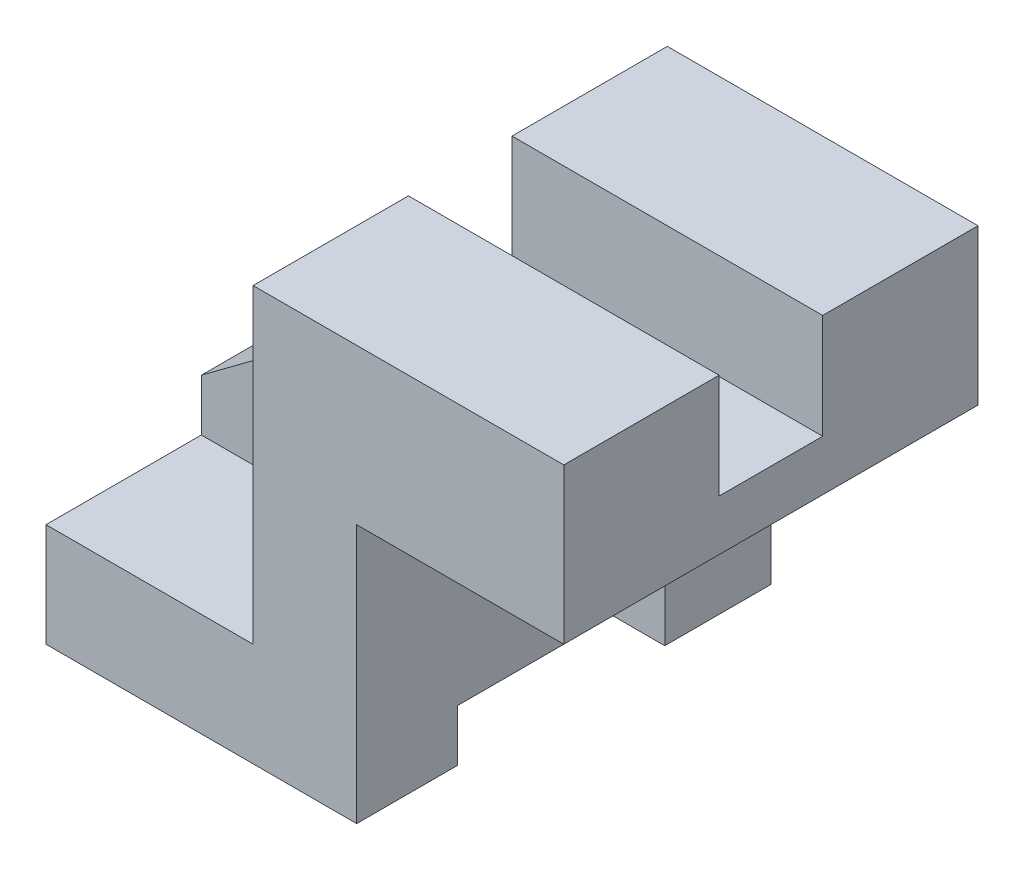
ISO-10303-21;
HEADER;
FILE_DESCRIPTION(('STEP AP214'),'2;1');
FILE_NAME('part.step','',(''),(''),'','','');
FILE_SCHEMA(('AUTOMOTIVE_DESIGN { 1 0 10303 214 1 1 1 1 }'));
ENDSEC;
DATA;
#1=APPLICATION_CONTEXT('core data for automotive mechanical design processes');
#2=APPLICATION_PROTOCOL_DEFINITION('international standard','automotive_design',2000,#1);
#3=PRODUCT_CONTEXT('',#1,'mechanical');
#4=PRODUCT('Part','Part','',(#3));
#5=PRODUCT_RELATED_PRODUCT_CATEGORY('part','',(#4));
#6=PRODUCT_DEFINITION_FORMATION('','',#4);
#7=PRODUCT_DEFINITION_CONTEXT('part definition',#1,'design');
#8=PRODUCT_DEFINITION('design','',#6,#7);
#9=PRODUCT_DEFINITION_SHAPE('','',#8);
#10=(LENGTH_UNIT() NAMED_UNIT(*) SI_UNIT(.MILLI.,.METRE.));
#11=(NAMED_UNIT(*) PLANE_ANGLE_UNIT() SI_UNIT($,.RADIAN.));
#12=(NAMED_UNIT(*) SI_UNIT($,.STERADIAN.) SOLID_ANGLE_UNIT());
#13=UNCERTAINTY_MEASURE_WITH_UNIT(LENGTH_MEASURE(1.E-05),#10,'distance_accuracy_value','');
#14=(GEOMETRIC_REPRESENTATION_CONTEXT(3) GLOBAL_UNCERTAINTY_ASSIGNED_CONTEXT((#13)) GLOBAL_UNIT_ASSIGNED_CONTEXT((#10,
#11,#12)) REPRESENTATION_CONTEXT('',''));
#15=CARTESIAN_POINT('',(0.,0.,0.));
#16=DIRECTION('',(0.,0.,1.));
#17=DIRECTION('',(1.,0.,0.));
#18=AXIS2_PLACEMENT_3D('',#15,#16,#17);
#19=CARTESIAN_POINT('',(0.,-48.7234042553192,40.));
#20=DIRECTION('',(0.,1.,0.));
#21=DIRECTION('',(0.,0.,1.));
#22=AXIS2_PLACEMENT_3D('',#19,#20,#21);
#23=PLANE('',#22);
#24=DIRECTION('',(0.,0.,-1.));
#25=VECTOR('',#24,1.);
#26=CARTESIAN_POINT('',(5.26825958416131,-48.7234042553192,40.));
#27=LINE('',#26,#25);
#28=CARTESIAN_POINT('',(5.26825958416131,-48.7234042553192,-19.5023751585269));
#29=VERTEX_POINT('',#28);
#30=CARTESIAN_POINT('',(5.26825958416131,-48.7234042553192,-40.));
#31=VERTEX_POINT('',#30);
#32=EDGE_CURVE('E192',#29,#31,#27,.T.);
#33=ORIENTED_EDGE('',*,*,#32,.F.);
#34=DIRECTION('',(-1.,0.,0.));
#35=VECTOR('',#34,1.);
#36=CARTESIAN_POINT('',(45.2692595841614,-48.7234042553191,-19.5023751585269));
#37=LINE('',#36,#35);
#38=CARTESIAN_POINT('',(-54.7317404158387,-48.7234042553192,-19.5023751585269));
#39=VERTEX_POINT('',#38);
#40=EDGE_CURVE('E177',#29,#39,#37,.T.);
#41=ORIENTED_EDGE('',*,*,#40,.T.);
#42=DIRECTION('',(0.,0.,-1.));
#43=VECTOR('',#42,1.);
#44=CARTESIAN_POINT('',(-54.7317404158387,-48.7234042553192,40.));
#45=LINE('',#44,#43);
#46=CARTESIAN_POINT('',(-54.7317404158387,-48.7234042553192,-40.));
#47=VERTEX_POINT('',#46);
#48=EDGE_CURVE('E207',#39,#47,#45,.T.);
#49=ORIENTED_EDGE('',*,*,#48,.T.);
#50=DIRECTION('',(1.,0.,0.));
#51=VECTOR('',#50,1.);
#52=CARTESIAN_POINT('',(0.,-48.7234042553192,-40.));
#53=LINE('',#52,#51);
#54=EDGE_CURVE('E198',#47,#31,#53,.T.);
#55=ORIENTED_EDGE('',*,*,#54,.T.);
#56=EDGE_LOOP('',(#33,#41,#49,#55));
#57=FACE_BOUND('',#56,.T.);
#58=ADVANCED_FACE('F45',(#57),#23,.F.);
#59=CARTESIAN_POINT('',(-14.7317404158387,0.,40.));
#60=DIRECTION('',(-1.,0.,0.));
#61=DIRECTION('',(0.,-1.,0.));
#62=AXIS2_PLACEMENT_3D('',#59,#60,#61);
#63=PLANE('',#62);
#64=DIRECTION('',(0.,-1.,0.));
#65=VECTOR('',#64,1.);
#66=CARTESIAN_POINT('',(-14.7317404158387,11.063829787234,-10.));
#67=LINE('',#66,#65);
#68=CARTESIAN_POINT('',(-14.7317404158387,31.2765957446809,-10.));
#69=VERTEX_POINT('',#68);
#70=CARTESIAN_POINT('',(-14.7317404158387,11.063829787234,-10.));
#71=VERTEX_POINT('',#70);
#72=EDGE_CURVE('E370',#69,#71,#67,.T.);
#73=ORIENTED_EDGE('',*,*,#72,.F.);
#74=DIRECTION('',(0.,0.,-1.));
#75=VECTOR('',#74,1.);
#76=CARTESIAN_POINT('',(-14.7317404158387,31.2765957446809,40.));
#77=LINE('',#76,#75);
#78=CARTESIAN_POINT('',(-14.7317404158387,31.2765957446809,-40.));
#79=VERTEX_POINT('',#78);
#80=EDGE_CURVE('E309',#69,#79,#77,.T.);
#81=ORIENTED_EDGE('',*,*,#80,.T.);
#82=DIRECTION('',(0.,1.,0.));
#83=VECTOR('',#82,1.);
#84=CARTESIAN_POINT('',(-14.7317404158387,0.,-40.));
#85=LINE('',#84,#83);
#86=CARTESIAN_POINT('',(-14.7317404158387,-28.7234042553192,-40.));
#87=VERTEX_POINT('',#86);
#88=EDGE_CURVE('E282',#87,#79,#85,.T.);
#89=ORIENTED_EDGE('',*,*,#88,.F.);
#90=DIRECTION('',(0.,0.,-1.));
#91=VECTOR('',#90,1.);
#92=CARTESIAN_POINT('',(-14.7317404158387,-28.7234042553192,-10.));
#93=LINE('',#92,#91);
#94=CARTESIAN_POINT('',(-14.7317404158387,-28.7234042553192,-10.));
#95=VERTEX_POINT('',#94);
#96=EDGE_CURVE('E252',#95,#87,#93,.T.);
#97=ORIENTED_EDGE('',*,*,#96,.F.);
#98=DIRECTION('',(0.,-1.,0.));
#99=VECTOR('',#98,1.);
#100=CARTESIAN_POINT('',(-14.7317404158387,11.063829787234,-10.));
#101=LINE('',#100,#99);
#102=EDGE_CURVE('E239',#71,#95,#101,.T.);
#103=ORIENTED_EDGE('',*,*,#102,.F.);
#104=EDGE_LOOP('',(#73,#81,#89,#97,#103));
#105=FACE_BOUND('',#104,.T.);
#106=ADVANCED_FACE('F367',(#105),#63,.T.);
#107=CARTESIAN_POINT('',(0.,31.2765957446809,40.));
#108=DIRECTION('',(0.,-1.,0.));
#109=DIRECTION('',(0.,0.,-1.));
#110=AXIS2_PLACEMENT_3D('',#107,#108,#109);
#111=PLANE('',#110);
#112=ORIENTED_EDGE('',*,*,#80,.F.);
#113=DIRECTION('',(-1.,0.,0.));
#114=VECTOR('',#113,1.);
#115=CARTESIAN_POINT('',(45.2692595841614,31.2765957446808,-10.));
#116=LINE('',#115,#114);
#117=CARTESIAN_POINT('',(45.2682595841613,31.2765957446808,-10.));
#118=VERTEX_POINT('',#117);
#119=EDGE_CURVE('E361',#118,#69,#116,.T.);
#120=ORIENTED_EDGE('',*,*,#119,.F.);
#121=DIRECTION('',(0.,0.,-1.));
#122=VECTOR('',#121,1.);
#123=CARTESIAN_POINT('',(45.2682595841613,31.2765957446809,40.));
#124=LINE('',#123,#122);
#125=CARTESIAN_POINT('',(45.2682595841613,31.2765957446809,-40.));
#126=VERTEX_POINT('',#125);
#127=EDGE_CURVE('E336',#118,#126,#124,.T.);
#128=ORIENTED_EDGE('',*,*,#127,.T.);
#129=DIRECTION('',(-1.,0.,0.));
#130=VECTOR('',#129,1.);
#131=CARTESIAN_POINT('',(0.,31.2765957446809,-40.));
#132=LINE('',#131,#130);
#133=EDGE_CURVE('E291',#126,#79,#132,.T.);
#134=ORIENTED_EDGE('',*,*,#133,.T.);
#135=EDGE_LOOP('',(#112,#120,#128,#134));
#136=FACE_BOUND('',#135,.T.);
#137=ADVANCED_FACE('F359',(#136),#111,.F.);
#138=DIRECTION('',(0.,1.,0.));
#139=VECTOR('',#138,1.);
#140=CARTESIAN_POINT('',(-14.7317404158387,11.063829787234,10.));
#141=LINE('',#140,#139);
#142=CARTESIAN_POINT('',(-14.7317404158387,11.063829787234,10.));
#143=VERTEX_POINT('',#142);
#144=CARTESIAN_POINT('',(-14.7317404158387,31.2765957446809,10.));
#145=VERTEX_POINT('',#144);
#146=EDGE_CURVE('E69',#143,#145,#141,.T.);
#147=ORIENTED_EDGE('',*,*,#146,.F.);
#148=DIRECTION('',(0.,1.,0.));
#149=VECTOR('',#148,1.);
#150=CARTESIAN_POINT('',(-14.7317404158387,11.063829787234,10.));
#151=LINE('',#150,#149);
#152=CARTESIAN_POINT('',(-14.7317404158387,-28.7234042553192,10.));
#153=VERTEX_POINT('',#152);
#154=EDGE_CURVE('E267',#153,#143,#151,.T.);
#155=ORIENTED_EDGE('',*,*,#154,.F.);
#156=DIRECTION('',(0.,0.,1.));
#157=VECTOR('',#156,1.);
#158=CARTESIAN_POINT('',(-14.7317404158387,-28.7234042553192,10.));
#159=LINE('',#158,#157);
#160=CARTESIAN_POINT('',(-14.7317404158387,-28.7234042553192,40.));
#161=VERTEX_POINT('',#160);
#162=EDGE_CURVE('E275',#153,#161,#159,.T.);
#163=ORIENTED_EDGE('',*,*,#162,.T.);
#164=DIRECTION('',(0.,1.,0.));
#165=VECTOR('',#164,1.);
#166=CARTESIAN_POINT('',(-14.7317404158387,0.,40.));
#167=LINE('',#166,#165);
#168=CARTESIAN_POINT('',(-14.7317404158387,31.2765957446809,40.));
#169=VERTEX_POINT('',#168);
#170=EDGE_CURVE('E286',#161,#169,#167,.T.);
#171=ORIENTED_EDGE('',*,*,#170,.T.);
#172=EDGE_CURVE('E332',#169,#145,#77,.T.);
#173=ORIENTED_EDGE('',*,*,#172,.T.);
#174=EDGE_LOOP('',(#147,#155,#163,#171,#173));
#175=FACE_BOUND('',#174,.T.);
#176=ADVANCED_FACE('F47',(#175),#63,.T.);
#177=CARTESIAN_POINT('',(-10.5551491000007,14.1740573628581,40.));
#178=DIRECTION('',(-0.597266145998167,0.802043110340396,0.));
#179=DIRECTION('',(-0.802043110340396,-0.597266145998167,0.));
#180=AXIS2_PLACEMENT_3D('',#177,#178,#179);
#181=PLANE('',#180);
#182=DIRECTION('',(0.802043110340396,0.597266145998167,0.));
#183=VECTOR('',#182,1.);
#184=CARTESIAN_POINT('',(-14.7317404158387,11.063829787234,-10.));
#185=LINE('',#184,#183);
#186=CARTESIAN_POINT('',(-54.7317404158387,-18.7234042553192,-10.));
#187=VERTEX_POINT('',#186);
#188=EDGE_CURVE('E234',#187,#71,#185,.T.);
#189=ORIENTED_EDGE('',*,*,#188,.F.);
#190=DIRECTION('',(0.,0.,-1.));
#191=VECTOR('',#190,1.);
#192=CARTESIAN_POINT('',(-54.7317404158387,-18.7234042553192,40.));
#193=LINE('',#192,#191);
#194=CARTESIAN_POINT('',(-54.7317404158387,-18.7234042553192,10.));
#195=VERTEX_POINT('',#194);
#196=EDGE_CURVE('E54',#195,#187,#193,.T.);
#197=ORIENTED_EDGE('',*,*,#196,.F.);
#198=DIRECTION('',(-0.802043110340396,-0.597266145998167,0.));
#199=VECTOR('',#198,1.);
#200=CARTESIAN_POINT('',(-54.7317404158387,-18.7234042553192,10.));
#201=LINE('',#200,#199);
#202=EDGE_CURVE('E232',#143,#195,#201,.T.);
#203=ORIENTED_EDGE('',*,*,#202,.F.);
#204=DIRECTION('',(0.,0.,-1.));
#205=VECTOR('',#204,1.);
#206=CARTESIAN_POINT('',(-14.7317404158387,11.063829787234,40.));
#207=LINE('',#206,#205);
#208=EDGE_CURVE('E11',#143,#71,#207,.T.);
#209=ORIENTED_EDGE('',*,*,#208,.T.);
#210=EDGE_LOOP('',(#189,#197,#203,#209));
#211=FACE_BOUND('',#210,.T.);
#212=ADVANCED_FACE('F231',(#211),#181,.T.);
#213=CARTESIAN_POINT('',(-54.7317404158387,0.,40.));
#214=DIRECTION('',(1.,0.,0.));
#215=DIRECTION('',(0.,1.,0.));
#216=AXIS2_PLACEMENT_3D('',#213,#214,#215);
#217=PLANE('',#216);
#218=ORIENTED_EDGE('',*,*,#48,.F.);
#219=DIRECTION('',(0.,-1.,0.));
#220=VECTOR('',#219,1.);
#221=CARTESIAN_POINT('',(-54.7317404158387,-48.7234042553192,-19.5023751585269));
#222=LINE('',#221,#220);
#223=CARTESIAN_POINT('',(-54.7317404158387,-38.7234042553192,-19.5023751585269));
#224=VERTEX_POINT('',#223);
#225=EDGE_CURVE('E182',#224,#39,#222,.T.);
#226=ORIENTED_EDGE('',*,*,#225,.F.);
#227=DIRECTION('',(0.,0.,-1.));
#228=VECTOR('',#227,1.);
#229=CARTESIAN_POINT('',(-54.7317404158387,-38.7234042553192,-19.5023751585269));
#230=LINE('',#229,#228);
#231=CARTESIAN_POINT('',(-54.7317404158387,-38.7234042553192,20.4976248414731));
#232=VERTEX_POINT('',#231);
#233=EDGE_CURVE('E188',#232,#224,#230,.T.);
#234=ORIENTED_EDGE('',*,*,#233,.F.);
#235=DIRECTION('',(0.,1.,0.));
#236=VECTOR('',#235,1.);
#237=CARTESIAN_POINT('',(-54.7317404158387,-48.7234042553192,20.4976248414731));
#238=LINE('',#237,#236);
#239=CARTESIAN_POINT('',(-54.7317404158387,-48.7234042553192,20.4976248414731));
#240=VERTEX_POINT('',#239);
#241=EDGE_CURVE('E412',#240,#232,#238,.T.);
#242=ORIENTED_EDGE('',*,*,#241,.F.);
#243=CARTESIAN_POINT('',(-54.7317404158387,-48.7234042553192,40.));
#244=VERTEX_POINT('',#243);
#245=EDGE_CURVE('E213',#244,#240,#45,.T.);
#246=ORIENTED_EDGE('',*,*,#245,.F.);
#247=DIRECTION('',(0.,-1.,0.));
#248=VECTOR('',#247,1.);
#249=CARTESIAN_POINT('',(-54.7317404158387,0.,40.));
#250=LINE('',#249,#248);
#251=CARTESIAN_POINT('',(-54.7317404158387,-28.7234042553192,40.));
#252=VERTEX_POINT('',#251);
#253=EDGE_CURVE('E290',#252,#244,#250,.T.);
#254=ORIENTED_EDGE('',*,*,#253,.F.);
#255=DIRECTION('',(0.,0.,1.));
#256=VECTOR('',#255,1.);
#257=CARTESIAN_POINT('',(-54.7317404158387,-28.7234042553192,10.));
#258=LINE('',#257,#256);
#259=CARTESIAN_POINT('',(-54.7317404158387,-28.7234042553192,10.));
#260=VERTEX_POINT('',#259);
#261=EDGE_CURVE('E279',#260,#252,#258,.T.);
#262=ORIENTED_EDGE('',*,*,#261,.F.);
#263=DIRECTION('',(0.,-1.,0.));
#264=VECTOR('',#263,1.);
#265=CARTESIAN_POINT('',(-54.7317404158387,-18.7234042553192,10.));
#266=LINE('',#265,#264);
#267=EDGE_CURVE('E227',#195,#260,#266,.T.);
#268=ORIENTED_EDGE('',*,*,#267,.F.);
#269=ORIENTED_EDGE('',*,*,#196,.T.);
#270=DIRECTION('',(0.,1.,0.));
#271=VECTOR('',#270,1.);
#272=CARTESIAN_POINT('',(-54.7317404158387,-18.7234042553192,-10.));
#273=LINE('',#272,#271);
#274=CARTESIAN_POINT('',(-54.7317404158387,-28.7234042553192,-10.));
#275=VERTEX_POINT('',#274);
#276=EDGE_CURVE('E224',#275,#187,#273,.T.);
#277=ORIENTED_EDGE('',*,*,#276,.F.);
#278=DIRECTION('',(0.,0.,-1.));
#279=VECTOR('',#278,1.);
#280=CARTESIAN_POINT('',(-54.7317404158387,-28.7234042553192,-10.));
#281=LINE('',#280,#279);
#282=CARTESIAN_POINT('',(-54.7317404158387,-28.7234042553192,-40.));
#283=VERTEX_POINT('',#282);
#284=EDGE_CURVE('E256',#275,#283,#281,.T.);
#285=ORIENTED_EDGE('',*,*,#284,.T.);
#286=DIRECTION('',(0.,-1.,0.));
#287=VECTOR('',#286,1.);
#288=CARTESIAN_POINT('',(-54.7317404158387,0.,-40.));
#289=LINE('',#288,#287);
#290=EDGE_CURVE('E313',#283,#47,#289,.T.);
#291=ORIENTED_EDGE('',*,*,#290,.T.);
#292=EDGE_LOOP('',(#218,#226,#234,#242,#246,#254,#262,#268,#269,#277,#285,#291));
#293=FACE_BOUND('',#292,.T.);
#294=ADVANCED_FACE('F222',(#293),#217,.F.);
#295=ORIENTED_EDGE('',*,*,#245,.T.);
#296=DIRECTION('',(-1.,0.,0.));
#297=VECTOR('',#296,1.);
#298=CARTESIAN_POINT('',(45.2692595841614,-48.7234042553191,20.4976248414731));
#299=LINE('',#298,#297);
#300=CARTESIAN_POINT('',(5.26825958416131,-48.7234042553191,20.4976248414731));
#301=VERTEX_POINT('',#300);
#302=EDGE_CURVE('E187',#301,#240,#299,.T.);
#303=ORIENTED_EDGE('',*,*,#302,.F.);
#304=CARTESIAN_POINT('',(5.26825958416131,-48.7234042553192,40.));
#305=VERTEX_POINT('',#304);
#306=EDGE_CURVE('E201',#305,#301,#27,.T.);
#307=ORIENTED_EDGE('',*,*,#306,.F.);
#308=DIRECTION('',(1.,0.,0.));
#309=VECTOR('',#308,1.);
#310=CARTESIAN_POINT('',(0.,-48.7234042553192,40.));
#311=LINE('',#310,#309);
#312=EDGE_CURVE('E294',#244,#305,#311,.T.);
#313=ORIENTED_EDGE('',*,*,#312,.F.);
#314=EDGE_LOOP('',(#295,#303,#307,#313));
#315=FACE_BOUND('',#314,.T.);
#316=ADVANCED_FACE('F428',(#315),#23,.F.);
#317=CARTESIAN_POINT('',(5.26825958416131,0.,40.));
#318=DIRECTION('',(-1.,0.,0.));
#319=DIRECTION('',(0.,0.,1.));
#320=AXIS2_PLACEMENT_3D('',#317,#318,#319);
#321=PLANE('',#320);
#322=DIRECTION('',(0.,0.,1.));
#323=VECTOR('',#322,1.);
#324=CARTESIAN_POINT('',(5.26825958416131,-38.7234042553191,-19.5023751585269));
#325=LINE('',#324,#323);
#326=CARTESIAN_POINT('',(5.26825958416131,-38.7234042553191,-19.5023751585269));
#327=VERTEX_POINT('',#326);
#328=CARTESIAN_POINT('',(5.26825958416131,-38.7234042553191,20.4976248414731));
#329=VERTEX_POINT('',#328);
#330=EDGE_CURVE('E61',#327,#329,#325,.T.);
#331=ORIENTED_EDGE('',*,*,#330,.F.);
#332=DIRECTION('',(0.,1.,0.));
#333=VECTOR('',#332,1.);
#334=CARTESIAN_POINT('',(5.26825958416131,-48.7234042553191,-19.5023751585269));
#335=LINE('',#334,#333);
#336=EDGE_CURVE('E180',#29,#327,#335,.T.);
#337=ORIENTED_EDGE('',*,*,#336,.F.);
#338=ORIENTED_EDGE('',*,*,#32,.T.);
#339=DIRECTION('',(0.,1.,0.));
#340=VECTOR('',#339,1.);
#341=CARTESIAN_POINT('',(5.26825958416131,0.,-40.));
#342=LINE('',#341,#340);
#343=CARTESIAN_POINT('',(5.26825958416131,1.27659574468085,-40.));
#344=VERTEX_POINT('',#343);
#345=EDGE_CURVE('E319',#31,#344,#342,.T.);
#346=ORIENTED_EDGE('',*,*,#345,.T.);
#347=DIRECTION('',(0.,0.,-1.));
#348=VECTOR('',#347,1.);
#349=CARTESIAN_POINT('',(5.26825958416131,1.27659574468085,40.));
#350=LINE('',#349,#348);
#351=CARTESIAN_POINT('',(5.26825958416131,1.27659574468085,40.));
#352=VERTEX_POINT('',#351);
#353=EDGE_CURVE('E202',#352,#344,#350,.T.);
#354=ORIENTED_EDGE('',*,*,#353,.F.);
#355=DIRECTION('',(0.,1.,0.));
#356=VECTOR('',#355,1.);
#357=CARTESIAN_POINT('',(5.26825958416131,0.,40.));
#358=LINE('',#357,#356);
#359=EDGE_CURVE('E297',#305,#352,#358,.T.);
#360=ORIENTED_EDGE('',*,*,#359,.F.);
#361=ORIENTED_EDGE('',*,*,#306,.T.);
#362=DIRECTION('',(0.,-1.,0.));
#363=VECTOR('',#362,1.);
#364=CARTESIAN_POINT('',(5.26825958416131,-48.7234042553191,20.4976248414731));
#365=LINE('',#364,#363);
#366=EDGE_CURVE('E420',#329,#301,#365,.T.);
#367=ORIENTED_EDGE('',*,*,#366,.F.);
#368=EDGE_LOOP('',(#331,#337,#338,#346,#354,#360,#361,#367));
#369=FACE_BOUND('',#368,.T.);
#370=ADVANCED_FACE('F191',(#369),#321,.F.);
#371=CARTESIAN_POINT('',(0.,1.27659574468085,40.));
#372=DIRECTION('',(0.,1.,0.));
#373=DIRECTION('',(0.,0.,1.));
#374=AXIS2_PLACEMENT_3D('',#371,#372,#373);
#375=PLANE('',#374);
#376=DIRECTION('',(1.,0.,0.));
#377=VECTOR('',#376,1.);
#378=CARTESIAN_POINT('',(0.,1.27659574468085,-40.));
#379=LINE('',#378,#377);
#380=CARTESIAN_POINT('',(45.2682595841613,1.27659574468085,-40.));
#381=VERTEX_POINT('',#380);
#382=EDGE_CURVE('E322',#344,#381,#379,.T.);
#383=ORIENTED_EDGE('',*,*,#382,.T.);
#384=DIRECTION('',(0.,0.,-1.));
#385=VECTOR('',#384,1.);
#386=CARTESIAN_POINT('',(45.2682595841613,1.27659574468085,40.));
#387=LINE('',#386,#385);
#388=CARTESIAN_POINT('',(45.2682595841613,1.27659574468085,40.));
#389=VERTEX_POINT('',#388);
#390=EDGE_CURVE('E209',#389,#381,#387,.T.);
#391=ORIENTED_EDGE('',*,*,#390,.F.);
#392=DIRECTION('',(1.,0.,0.));
#393=VECTOR('',#392,1.);
#394=CARTESIAN_POINT('',(0.,1.27659574468085,40.));
#395=LINE('',#394,#393);
#396=EDGE_CURVE('E300',#352,#389,#395,.T.);
#397=ORIENTED_EDGE('',*,*,#396,.F.);
#398=ORIENTED_EDGE('',*,*,#353,.T.);
#399=EDGE_LOOP('',(#383,#391,#397,#398));
#400=FACE_BOUND('',#399,.T.);
#401=ADVANCED_FACE('F459',(#400),#375,.F.);
#402=CARTESIAN_POINT('',(45.2682595841613,0.,40.));
#403=DIRECTION('',(-1.,0.,0.));
#404=DIRECTION('',(0.,-1.,0.));
#405=AXIS2_PLACEMENT_3D('',#402,#403,#404);
#406=PLANE('',#405);
#407=ORIENTED_EDGE('',*,*,#127,.F.);
#408=DIRECTION('',(0.,1.,0.));
#409=VECTOR('',#408,1.);
#410=CARTESIAN_POINT('',(45.2682595841613,11.063829787234,-10.));
#411=LINE('',#410,#409);
#412=CARTESIAN_POINT('',(45.2682595841613,11.063829787234,-10.));
#413=VERTEX_POINT('',#412);
#414=EDGE_CURVE('E379',#413,#118,#411,.T.);
#415=ORIENTED_EDGE('',*,*,#414,.F.);
#416=DIRECTION('',(0.,0.,-1.));
#417=VECTOR('',#416,1.);
#418=CARTESIAN_POINT('',(45.2682595841613,11.063829787234,-10.));
#419=LINE('',#418,#417);
#420=CARTESIAN_POINT('',(45.2682595841613,11.063829787234,10.));
#421=VERTEX_POINT('',#420);
#422=EDGE_CURVE('E395',#421,#413,#419,.T.);
#423=ORIENTED_EDGE('',*,*,#422,.F.);
#424=DIRECTION('',(0.,-1.,0.));
#425=VECTOR('',#424,1.);
#426=CARTESIAN_POINT('',(45.2682595841613,11.063829787234,10.));
#427=LINE('',#426,#425);
#428=CARTESIAN_POINT('',(45.2682595841613,31.2765957446808,10.));
#429=VERTEX_POINT('',#428);
#430=EDGE_CURVE('E255',#429,#421,#427,.T.);
#431=ORIENTED_EDGE('',*,*,#430,.F.);
#432=CARTESIAN_POINT('',(45.2682595841613,31.2765957446809,40.));
#433=VERTEX_POINT('',#432);
#434=EDGE_CURVE('E337',#433,#429,#124,.T.);
#435=ORIENTED_EDGE('',*,*,#434,.F.);
#436=DIRECTION('',(0.,1.,0.));
#437=VECTOR('',#436,1.);
#438=CARTESIAN_POINT('',(45.2682595841613,0.,40.));
#439=LINE('',#438,#437);
#440=EDGE_CURVE('E303',#389,#433,#439,.T.);
#441=ORIENTED_EDGE('',*,*,#440,.F.);
#442=ORIENTED_EDGE('',*,*,#390,.T.);
#443=DIRECTION('',(0.,1.,0.));
#444=VECTOR('',#443,1.);
#445=CARTESIAN_POINT('',(45.2682595841613,0.,-40.));
#446=LINE('',#445,#444);
#447=EDGE_CURVE('E325',#381,#126,#446,.T.);
#448=ORIENTED_EDGE('',*,*,#447,.T.);
#449=EDGE_LOOP('',(#407,#415,#423,#431,#435,#441,#442,#448));
#450=FACE_BOUND('',#449,.T.);
#451=ADVANCED_FACE('F347',(#450),#406,.F.);
#452=ORIENTED_EDGE('',*,*,#434,.T.);
#453=DIRECTION('',(-1.,0.,0.));
#454=VECTOR('',#453,1.);
#455=CARTESIAN_POINT('',(45.2692595841614,31.2765957446808,10.));
#456=LINE('',#455,#454);
#457=EDGE_CURVE('E377',#429,#145,#456,.T.);
#458=ORIENTED_EDGE('',*,*,#457,.T.);
#459=ORIENTED_EDGE('',*,*,#172,.F.);
#460=DIRECTION('',(-1.,0.,0.));
#461=VECTOR('',#460,1.);
#462=CARTESIAN_POINT('',(0.,31.2765957446809,40.));
#463=LINE('',#462,#461);
#464=EDGE_CURVE('E306',#433,#169,#463,.T.);
#465=ORIENTED_EDGE('',*,*,#464,.F.);
#466=EDGE_LOOP('',(#452,#458,#459,#465));
#467=FACE_BOUND('',#466,.T.);
#468=ADVANCED_FACE('F471',(#467),#111,.F.);
#469=CARTESIAN_POINT('',(0.,0.,40.));
#470=DIRECTION('',(0.,0.,1.));
#471=DIRECTION('',(1.,0.,0.));
#472=AXIS2_PLACEMENT_3D('',#469,#470,#471);
#473=PLANE('',#472);
#474=DIRECTION('',(1.,0.,0.));
#475=VECTOR('',#474,1.);
#476=CARTESIAN_POINT('',(-54.7317404158387,-28.7234042553192,40.));
#477=LINE('',#476,#475);
#478=EDGE_CURVE('E259',#252,#161,#477,.T.);
#479=ORIENTED_EDGE('',*,*,#478,.F.);
#480=ORIENTED_EDGE('',*,*,#253,.T.);
#481=ORIENTED_EDGE('',*,*,#312,.T.);
#482=ORIENTED_EDGE('',*,*,#359,.T.);
#483=ORIENTED_EDGE('',*,*,#396,.T.);
#484=ORIENTED_EDGE('',*,*,#440,.T.);
#485=ORIENTED_EDGE('',*,*,#464,.T.);
#486=ORIENTED_EDGE('',*,*,#170,.F.);
#487=EDGE_LOOP('',(#479,#480,#481,#482,#483,#484,#485,#486));
#488=FACE_BOUND('',#487,.T.);
#489=ADVANCED_FACE('F435',(#488),#473,.T.);
#490=CARTESIAN_POINT('',(0.,0.,-40.));
#491=DIRECTION('',(0.,0.,1.));
#492=DIRECTION('',(1.,0.,0.));
#493=AXIS2_PLACEMENT_3D('',#490,#491,#492);
#494=PLANE('',#493);
#495=ORIENTED_EDGE('',*,*,#290,.F.);
#496=DIRECTION('',(-1.,0.,0.));
#497=VECTOR('',#496,1.);
#498=CARTESIAN_POINT('',(-54.7317404158387,-28.7234042553192,-40.));
#499=LINE('',#498,#497);
#500=EDGE_CURVE('E245',#87,#283,#499,.T.);
#501=ORIENTED_EDGE('',*,*,#500,.F.);
#502=ORIENTED_EDGE('',*,*,#88,.T.);
#503=ORIENTED_EDGE('',*,*,#133,.F.);
#504=ORIENTED_EDGE('',*,*,#447,.F.);
#505=ORIENTED_EDGE('',*,*,#382,.F.);
#506=ORIENTED_EDGE('',*,*,#345,.F.);
#507=ORIENTED_EDGE('',*,*,#54,.F.);
#508=EDGE_LOOP('',(#495,#501,#502,#503,#504,#505,#506,#507));
#509=FACE_BOUND('',#508,.T.);
#510=ADVANCED_FACE('F355',(#509),#494,.F.);
#511=CARTESIAN_POINT('',(-54.7317404158387,-28.7234042553192,10.));
#512=DIRECTION('',(0.,-1.,0.));
#513=DIRECTION('',(0.,0.,-1.));
#514=AXIS2_PLACEMENT_3D('',#511,#512,#513);
#515=PLANE('',#514);
#516=ORIENTED_EDGE('',*,*,#478,.T.);
#517=ORIENTED_EDGE('',*,*,#162,.F.);
#518=DIRECTION('',(1.,0.,0.));
#519=VECTOR('',#518,1.);
#520=CARTESIAN_POINT('',(-54.7317404158387,-28.7234042553192,10.));
#521=LINE('',#520,#519);
#522=EDGE_CURVE('E263',#260,#153,#521,.T.);
#523=ORIENTED_EDGE('',*,*,#522,.F.);
#524=ORIENTED_EDGE('',*,*,#261,.T.);
#525=EDGE_LOOP('',(#516,#517,#523,#524));
#526=FACE_BOUND('',#525,.T.);
#527=ADVANCED_FACE('F477',(#526),#515,.F.);
#528=CARTESIAN_POINT('',(0.,0.,10.));
#529=DIRECTION('',(0.,0.,-1.));
#530=DIRECTION('',(-1.,0.,0.));
#531=AXIS2_PLACEMENT_3D('',#528,#529,#530);
#532=PLANE('',#531);
#533=ORIENTED_EDGE('',*,*,#522,.T.);
#534=ORIENTED_EDGE('',*,*,#154,.T.);
#535=ORIENTED_EDGE('',*,*,#202,.T.);
#536=ORIENTED_EDGE('',*,*,#267,.T.);
#537=EDGE_LOOP('',(#533,#534,#535,#536));
#538=FACE_BOUND('',#537,.T.);
#539=ADVANCED_FACE('F475',(#538),#532,.F.);
#540=CARTESIAN_POINT('',(-54.7317404158387,-28.7234042553192,-10.));
#541=DIRECTION('',(0.,-1.,0.));
#542=DIRECTION('',(1.,0.,0.));
#543=AXIS2_PLACEMENT_3D('',#540,#541,#542);
#544=PLANE('',#543);
#545=ORIENTED_EDGE('',*,*,#500,.T.);
#546=ORIENTED_EDGE('',*,*,#284,.F.);
#547=DIRECTION('',(-1.,0.,0.));
#548=VECTOR('',#547,1.);
#549=CARTESIAN_POINT('',(-54.7317404158387,-28.7234042553192,-10.));
#550=LINE('',#549,#548);
#551=EDGE_CURVE('E243',#95,#275,#550,.T.);
#552=ORIENTED_EDGE('',*,*,#551,.F.);
#553=ORIENTED_EDGE('',*,*,#96,.T.);
#554=EDGE_LOOP('',(#545,#546,#552,#553));
#555=FACE_BOUND('',#554,.T.);
#556=ADVANCED_FACE('F517',(#555),#544,.F.);
#557=CARTESIAN_POINT('',(0.,0.,-10.));
#558=DIRECTION('',(0.,0.,1.));
#559=DIRECTION('',(1.,0.,0.));
#560=AXIS2_PLACEMENT_3D('',#557,#558,#559);
#561=PLANE('',#560);
#562=ORIENTED_EDGE('',*,*,#276,.T.);
#563=ORIENTED_EDGE('',*,*,#188,.T.);
#564=ORIENTED_EDGE('',*,*,#102,.T.);
#565=ORIENTED_EDGE('',*,*,#551,.T.);
#566=EDGE_LOOP('',(#562,#563,#564,#565));
#567=FACE_BOUND('',#566,.T.);
#568=ADVANCED_FACE('F527',(#567),#561,.F.);
#569=CARTESIAN_POINT('',(45.2692595841613,11.063829787234,-10.));
#570=DIRECTION('',(0.,-1.,0.));
#571=DIRECTION('',(1.,0.,0.));
#572=AXIS2_PLACEMENT_3D('',#569,#570,#571);
#573=PLANE('',#572);
#574=ORIENTED_EDGE('',*,*,#422,.T.);
#575=DIRECTION('',(-1.,0.,0.));
#576=VECTOR('',#575,1.);
#577=CARTESIAN_POINT('',(45.2692595841613,11.063829787234,-10.));
#578=LINE('',#577,#576);
#579=EDGE_CURVE('E383',#413,#71,#578,.T.);
#580=ORIENTED_EDGE('',*,*,#579,.T.);
#581=ORIENTED_EDGE('',*,*,#208,.F.);
#582=DIRECTION('',(-1.,0.,0.));
#583=VECTOR('',#582,1.);
#584=CARTESIAN_POINT('',(45.2692595841613,11.063829787234,10.));
#585=LINE('',#584,#583);
#586=EDGE_CURVE('E373',#421,#143,#585,.T.);
#587=ORIENTED_EDGE('',*,*,#586,.F.);
#588=EDGE_LOOP('',(#574,#580,#581,#587));
#589=FACE_BOUND('',#588,.T.);
#590=ADVANCED_FACE('F532',(#589),#573,.F.);
#591=CARTESIAN_POINT('',(45.2692595841613,11.063829787234,-10.));
#592=DIRECTION('',(0.,0.,-1.));
#593=DIRECTION('',(-1.,0.,0.));
#594=AXIS2_PLACEMENT_3D('',#591,#592,#593);
#595=PLANE('',#594);
#596=ORIENTED_EDGE('',*,*,#414,.T.);
#597=ORIENTED_EDGE('',*,*,#119,.T.);
#598=ORIENTED_EDGE('',*,*,#72,.T.);
#599=ORIENTED_EDGE('',*,*,#579,.F.);
#600=EDGE_LOOP('',(#596,#597,#598,#599));
#601=FACE_BOUND('',#600,.T.);
#602=ADVANCED_FACE('F544',(#601),#595,.F.);
#603=CARTESIAN_POINT('',(45.2692595841613,11.063829787234,10.));
#604=DIRECTION('',(0.,0.,1.));
#605=DIRECTION('',(1.,0.,0.));
#606=AXIS2_PLACEMENT_3D('',#603,#604,#605);
#607=PLANE('',#606);
#608=ORIENTED_EDGE('',*,*,#430,.T.);
#609=ORIENTED_EDGE('',*,*,#586,.T.);
#610=ORIENTED_EDGE('',*,*,#146,.T.);
#611=ORIENTED_EDGE('',*,*,#457,.F.);
#612=EDGE_LOOP('',(#608,#609,#610,#611));
#613=FACE_BOUND('',#612,.T.);
#614=ADVANCED_FACE('F393',(#613),#607,.F.);
#615=CARTESIAN_POINT('',(45.2692595841614,-48.7234042553191,-19.5023751585269));
#616=DIRECTION('',(0.,0.,-1.));
#617=DIRECTION('',(-1.,0.,0.));
#618=AXIS2_PLACEMENT_3D('',#615,#616,#617);
#619=PLANE('',#618);
#620=ORIENTED_EDGE('',*,*,#336,.T.);
#621=DIRECTION('',(-1.,0.,0.));
#622=VECTOR('',#621,1.);
#623=CARTESIAN_POINT('',(45.2692595841614,-38.7234042553191,-19.5023751585269));
#624=LINE('',#623,#622);
#625=EDGE_CURVE('E398',#327,#224,#624,.T.);
#626=ORIENTED_EDGE('',*,*,#625,.T.);
#627=ORIENTED_EDGE('',*,*,#225,.T.);
#628=ORIENTED_EDGE('',*,*,#40,.F.);
#629=EDGE_LOOP('',(#620,#626,#627,#628));
#630=FACE_BOUND('',#629,.T.);
#631=ADVANCED_FACE('F179',(#630),#619,.F.);
#632=CARTESIAN_POINT('',(45.2692595841614,-38.7234042553191,-19.5023751585269));
#633=DIRECTION('',(0.,1.,0.));
#634=DIRECTION('',(-1.,0.,0.));
#635=AXIS2_PLACEMENT_3D('',#632,#633,#634);
#636=PLANE('',#635);
#637=ORIENTED_EDGE('',*,*,#330,.T.);
#638=DIRECTION('',(-1.,0.,0.));
#639=VECTOR('',#638,1.);
#640=CARTESIAN_POINT('',(45.2692595841614,-38.7234042553191,20.4976248414731));
#641=LINE('',#640,#639);
#642=EDGE_CURVE('E402',#329,#232,#641,.T.);
#643=ORIENTED_EDGE('',*,*,#642,.T.);
#644=ORIENTED_EDGE('',*,*,#233,.T.);
#645=ORIENTED_EDGE('',*,*,#625,.F.);
#646=EDGE_LOOP('',(#637,#643,#644,#645));
#647=FACE_BOUND('',#646,.T.);
#648=ADVANCED_FACE('F438',(#647),#636,.F.);
#649=CARTESIAN_POINT('',(45.2692595841614,-48.7234042553191,20.4976248414731));
#650=DIRECTION('',(0.,0.,1.));
#651=DIRECTION('',(1.,0.,0.));
#652=AXIS2_PLACEMENT_3D('',#649,#650,#651);
#653=PLANE('',#652);
#654=ORIENTED_EDGE('',*,*,#366,.T.);
#655=ORIENTED_EDGE('',*,*,#302,.T.);
#656=ORIENTED_EDGE('',*,*,#241,.T.);
#657=ORIENTED_EDGE('',*,*,#642,.F.);
#658=EDGE_LOOP('',(#654,#655,#656,#657));
#659=FACE_BOUND('',#658,.T.);
#660=ADVANCED_FACE('F424',(#659),#653,.F.);
#661=CLOSED_SHELL('',(#58,#106,#137,#176,#212,#294,#316,#370,#401,#451,#468,#489,#510,#527,#539,
#556,#568,#590,#602,#614,#631,#648,#660));
#662=MANIFOLD_SOLID_BREP('B2',#661);
#663=ADVANCED_BREP_SHAPE_REPRESENTATION('',(#18,#662),#14);
#664=SHAPE_DEFINITION_REPRESENTATION(#9,#663);
ENDSEC;
END-ISO-10303-21;
